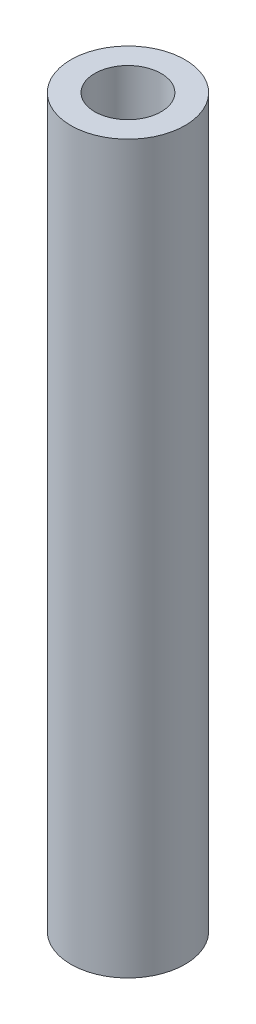
ISO-10303-21;
HEADER;
FILE_DESCRIPTION(('STEP AP214'),'2;1');
FILE_NAME('part.step','',(''),(''),'','','');
FILE_SCHEMA(('AUTOMOTIVE_DESIGN { 1 0 10303 214 1 1 1 1 }'));
ENDSEC;
DATA;
#1=APPLICATION_CONTEXT('core data for automotive mechanical design processes');
#2=APPLICATION_PROTOCOL_DEFINITION('international standard','automotive_design',2000,#1);
#3=PRODUCT_CONTEXT('',#1,'mechanical');
#4=PRODUCT('Part','Part','',(#3));
#5=PRODUCT_RELATED_PRODUCT_CATEGORY('part','',(#4));
#6=PRODUCT_DEFINITION_FORMATION('','',#4);
#7=PRODUCT_DEFINITION_CONTEXT('part definition',#1,'design');
#8=PRODUCT_DEFINITION('design','',#6,#7);
#9=PRODUCT_DEFINITION_SHAPE('','',#8);
#10=(LENGTH_UNIT() NAMED_UNIT(*) SI_UNIT(.MILLI.,.METRE.));
#11=(NAMED_UNIT(*) PLANE_ANGLE_UNIT() SI_UNIT($,.RADIAN.));
#12=(NAMED_UNIT(*) SI_UNIT($,.STERADIAN.) SOLID_ANGLE_UNIT());
#13=UNCERTAINTY_MEASURE_WITH_UNIT(LENGTH_MEASURE(1.E-05),#10,'distance_accuracy_value','');
#14=(GEOMETRIC_REPRESENTATION_CONTEXT(3) GLOBAL_UNCERTAINTY_ASSIGNED_CONTEXT((#13)) GLOBAL_UNIT_ASSIGNED_CONTEXT((#10,
#11,#12)) REPRESENTATION_CONTEXT('',''));
#15=CARTESIAN_POINT('',(0.,0.,0.));
#16=DIRECTION('',(0.,0.,1.));
#17=DIRECTION('',(1.,0.,0.));
#18=AXIS2_PLACEMENT_3D('',#15,#16,#17);
#19=CARTESIAN_POINT('',(0.,35.,0.));
#20=DIRECTION('',(0.,1.,0.));
#21=DIRECTION('',(0.,0.,1.));
#22=AXIS2_PLACEMENT_3D('',#19,#20,#21);
#23=PLANE('',#22);
#24=CARTESIAN_POINT('',(0.,35.,0.));
#25=DIRECTION('',(0.,1.,0.));
#26=DIRECTION('',(0.,0.,1.));
#27=AXIS2_PLACEMENT_3D('',#24,#25,#26);
#28=CIRCLE('',#27,2.75);
#29=CARTESIAN_POINT('',(0.,35.,2.75));
#30=VERTEX_POINT('',#29);
#31=EDGE_CURVE('E10',#30,#30,#28,.T.);
#32=ORIENTED_EDGE('',*,*,#31,.T.);
#33=EDGE_LOOP('',(#32));
#34=FACE_BOUND('',#33,.T.);
#35=CARTESIAN_POINT('',(0.,35.,0.));
#36=DIRECTION('',(0.,1.,0.));
#37=DIRECTION('',(0.,0.,1.));
#38=AXIS2_PLACEMENT_3D('',#35,#36,#37);
#39=CIRCLE('',#38,1.6);
#40=CARTESIAN_POINT('',(0.,35.,1.6));
#41=VERTEX_POINT('',#40);
#42=EDGE_CURVE('E50',#41,#41,#39,.T.);
#43=ORIENTED_EDGE('',*,*,#42,.F.);
#44=EDGE_LOOP('',(#43));
#45=FACE_BOUND('',#44,.T.);
#46=ADVANCED_FACE('F37',(#34,#45),#23,.T.);
#47=CARTESIAN_POINT('',(0.,0.,0.));
#48=DIRECTION('',(0.,1.,0.));
#49=DIRECTION('',(0.,0.,1.));
#50=AXIS2_PLACEMENT_3D('',#47,#48,#49);
#51=PLANE('',#50);
#52=CARTESIAN_POINT('',(0.,0.,0.));
#53=DIRECTION('',(0.,1.,0.));
#54=DIRECTION('',(0.,0.,1.));
#55=AXIS2_PLACEMENT_3D('',#52,#53,#54);
#56=CIRCLE('',#55,2.75);
#57=CARTESIAN_POINT('',(0.,0.,2.75));
#58=VERTEX_POINT('',#57);
#59=EDGE_CURVE('E41',#58,#58,#56,.T.);
#60=ORIENTED_EDGE('',*,*,#59,.F.);
#61=EDGE_LOOP('',(#60));
#62=FACE_BOUND('',#61,.T.);
#63=CARTESIAN_POINT('',(0.,0.,0.));
#64=DIRECTION('',(0.,1.,0.));
#65=DIRECTION('',(0.,0.,1.));
#66=AXIS2_PLACEMENT_3D('',#63,#64,#65);
#67=CIRCLE('',#66,1.6);
#68=CARTESIAN_POINT('',(0.,0.,1.6));
#69=VERTEX_POINT('',#68);
#70=EDGE_CURVE('E52',#69,#69,#67,.T.);
#71=ORIENTED_EDGE('',*,*,#70,.T.);
#72=EDGE_LOOP('',(#71));
#73=FACE_BOUND('',#72,.T.);
#74=ADVANCED_FACE('F64',(#62,#73),#51,.F.);
#75=CARTESIAN_POINT('',(0.,35.,0.));
#76=DIRECTION('',(0.,-1.,0.));
#77=DIRECTION('',(0.,0.,-1.));
#78=AXIS2_PLACEMENT_3D('',#75,#76,#77);
#79=CYLINDRICAL_SURFACE('',#78,2.75);
#80=ORIENTED_EDGE('',*,*,#31,.F.);
#81=EDGE_LOOP('',(#80));
#82=FACE_BOUND('',#81,.T.);
#83=ORIENTED_EDGE('',*,*,#59,.T.);
#84=EDGE_LOOP('',(#83));
#85=FACE_BOUND('',#84,.T.);
#86=ADVANCED_FACE('F39',(#82,#85),#79,.T.);
#87=CARTESIAN_POINT('',(0.,35.,0.));
#88=DIRECTION('',(0.,-1.,0.));
#89=DIRECTION('',(0.,0.,-1.));
#90=AXIS2_PLACEMENT_3D('',#87,#88,#89);
#91=CYLINDRICAL_SURFACE('',#90,1.6);
#92=ORIENTED_EDGE('',*,*,#42,.T.);
#93=EDGE_LOOP('',(#92));
#94=FACE_BOUND('',#93,.T.);
#95=ORIENTED_EDGE('',*,*,#70,.F.);
#96=EDGE_LOOP('',(#95));
#97=FACE_BOUND('',#96,.T.);
#98=ADVANCED_FACE('F60',(#94,#97),#91,.F.);
#99=CLOSED_SHELL('',(#46,#74,#86,#98));
#100=MANIFOLD_SOLID_BREP('B2',#99);
#101=ADVANCED_BREP_SHAPE_REPRESENTATION('',(#18,#100),#14);
#102=SHAPE_DEFINITION_REPRESENTATION(#9,#101);
ENDSEC;
END-ISO-10303-21;
